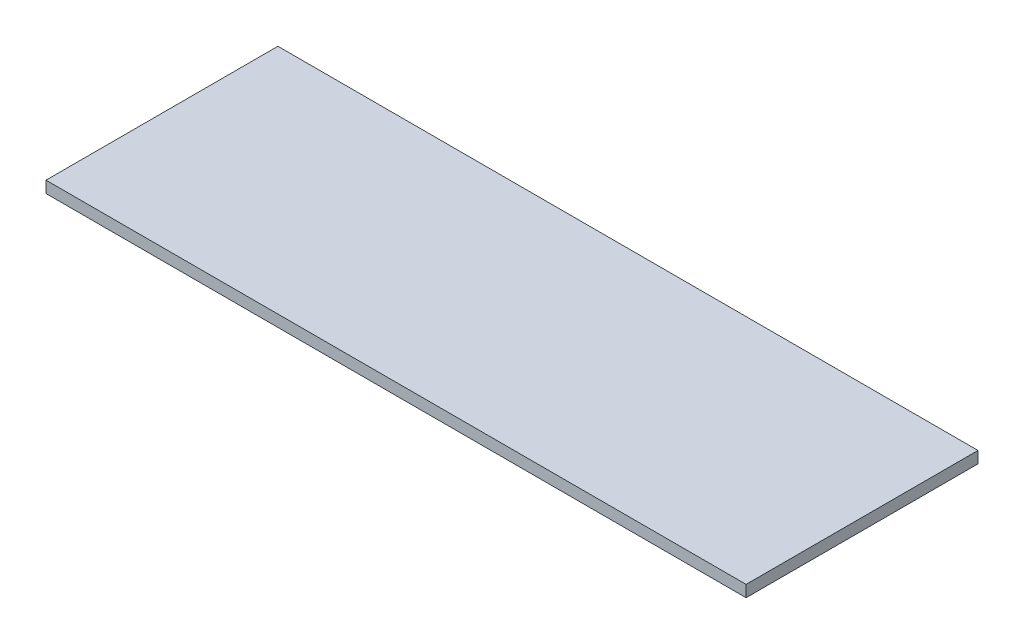
ISO-10303-21;
HEADER;
FILE_DESCRIPTION(('STEP AP214'),'2;1');
FILE_NAME('part.step','',(''),(''),'','','');
FILE_SCHEMA(('AUTOMOTIVE_DESIGN { 1 0 10303 214 1 1 1 1 }'));
ENDSEC;
DATA;
#1=APPLICATION_CONTEXT('core data for automotive mechanical design processes');
#2=APPLICATION_PROTOCOL_DEFINITION('international standard','automotive_design',2000,#1);
#3=PRODUCT_CONTEXT('',#1,'mechanical');
#4=PRODUCT('Part','Part','',(#3));
#5=PRODUCT_RELATED_PRODUCT_CATEGORY('part','',(#4));
#6=PRODUCT_DEFINITION_FORMATION('','',#4);
#7=PRODUCT_DEFINITION_CONTEXT('part definition',#1,'design');
#8=PRODUCT_DEFINITION('design','',#6,#7);
#9=PRODUCT_DEFINITION_SHAPE('','',#8);
#10=(LENGTH_UNIT() NAMED_UNIT(*) SI_UNIT(.MILLI.,.METRE.));
#11=(NAMED_UNIT(*) PLANE_ANGLE_UNIT() SI_UNIT($,.RADIAN.));
#12=(NAMED_UNIT(*) SI_UNIT($,.STERADIAN.) SOLID_ANGLE_UNIT());
#13=UNCERTAINTY_MEASURE_WITH_UNIT(LENGTH_MEASURE(1.E-05),#10,'distance_accuracy_value','');
#14=(GEOMETRIC_REPRESENTATION_CONTEXT(3) GLOBAL_UNCERTAINTY_ASSIGNED_CONTEXT((#13)) GLOBAL_UNIT_ASSIGNED_CONTEXT((#10,
#11,#12)) REPRESENTATION_CONTEXT('',''));
#15=CARTESIAN_POINT('',(0.,0.,0.));
#16=DIRECTION('',(0.,0.,1.));
#17=DIRECTION('',(1.,0.,0.));
#18=AXIS2_PLACEMENT_3D('',#15,#16,#17);
#19=CARTESIAN_POINT('',(0.,19.05,0.));
#20=DIRECTION('',(1.,0.,0.));
#21=DIRECTION('',(0.,0.,-1.));
#22=AXIS2_PLACEMENT_3D('',#19,#20,#21);
#23=PLANE('',#22);
#24=DIRECTION('',(0.,0.,1.));
#25=VECTOR('',#24,1.);
#26=CARTESIAN_POINT('',(0.,0.,0.));
#27=LINE('',#26,#25);
#28=CARTESIAN_POINT('',(0.,0.,0.));
#29=VERTEX_POINT('',#28);
#30=CARTESIAN_POINT('',(0.,0.,380.95));
#31=VERTEX_POINT('',#30);
#32=EDGE_CURVE('E102',#29,#31,#27,.T.);
#33=ORIENTED_EDGE('',*,*,#32,.T.);
#34=DIRECTION('',(0.,-1.,0.));
#35=VECTOR('',#34,1.);
#36=CARTESIAN_POINT('',(0.,19.05,380.95));
#37=LINE('',#36,#35);
#38=CARTESIAN_POINT('',(0.,19.05,380.95));
#39=VERTEX_POINT('',#38);
#40=EDGE_CURVE('E11',#39,#31,#37,.T.);
#41=ORIENTED_EDGE('',*,*,#40,.F.);
#42=DIRECTION('',(0.,0.,1.));
#43=VECTOR('',#42,1.);
#44=CARTESIAN_POINT('',(0.,19.05,0.));
#45=LINE('',#44,#43);
#46=CARTESIAN_POINT('',(0.,19.05,0.));
#47=VERTEX_POINT('',#46);
#48=EDGE_CURVE('E90',#47,#39,#45,.T.);
#49=ORIENTED_EDGE('',*,*,#48,.F.);
#50=DIRECTION('',(0.,-1.,0.));
#51=VECTOR('',#50,1.);
#52=CARTESIAN_POINT('',(0.,19.05,0.));
#53=LINE('',#52,#51);
#54=EDGE_CURVE('E98',#47,#29,#53,.T.);
#55=ORIENTED_EDGE('',*,*,#54,.T.);
#56=EDGE_LOOP('',(#33,#41,#49,#55));
#57=FACE_BOUND('',#56,.T.);
#58=ADVANCED_FACE('F39',(#57),#23,.F.);
#59=CARTESIAN_POINT('',(0.,19.05,380.95));
#60=DIRECTION('',(0.,0.,-1.));
#61=DIRECTION('',(-1.,0.,0.));
#62=AXIS2_PLACEMENT_3D('',#59,#60,#61);
#63=PLANE('',#62);
#64=DIRECTION('',(1.,0.,0.));
#65=VECTOR('',#64,1.);
#66=CARTESIAN_POINT('',(0.,0.,380.95));
#67=LINE('',#66,#65);
#68=CARTESIAN_POINT('',(1150.,0.,380.95));
#69=VERTEX_POINT('',#68);
#70=EDGE_CURVE('E94',#31,#69,#67,.T.);
#71=ORIENTED_EDGE('',*,*,#70,.T.);
#72=DIRECTION('',(0.,-1.,0.));
#73=VECTOR('',#72,1.);
#74=CARTESIAN_POINT('',(1150.,19.05,380.95));
#75=LINE('',#74,#73);
#76=CARTESIAN_POINT('',(1150.,19.05,380.95));
#77=VERTEX_POINT('',#76);
#78=EDGE_CURVE('E47',#77,#69,#75,.T.);
#79=ORIENTED_EDGE('',*,*,#78,.F.);
#80=DIRECTION('',(1.,0.,0.));
#81=VECTOR('',#80,1.);
#82=CARTESIAN_POINT('',(0.,19.05,380.95));
#83=LINE('',#82,#81);
#84=EDGE_CURVE('E85',#39,#77,#83,.T.);
#85=ORIENTED_EDGE('',*,*,#84,.F.);
#86=ORIENTED_EDGE('',*,*,#40,.T.);
#87=EDGE_LOOP('',(#71,#79,#85,#86));
#88=FACE_BOUND('',#87,.T.);
#89=ADVANCED_FACE('F93',(#88),#63,.F.);
#90=CARTESIAN_POINT('',(1150.,19.05,0.));
#91=DIRECTION('',(-1.,0.,0.));
#92=DIRECTION('',(0.,0.,1.));
#93=AXIS2_PLACEMENT_3D('',#90,#91,#92);
#94=PLANE('',#93);
#95=DIRECTION('',(0.,0.,-1.));
#96=VECTOR('',#95,1.);
#97=CARTESIAN_POINT('',(1150.,0.,0.));
#98=LINE('',#97,#96);
#99=CARTESIAN_POINT('',(1150.,0.,0.));
#100=VERTEX_POINT('',#99);
#101=EDGE_CURVE('E72',#69,#100,#98,.T.);
#102=ORIENTED_EDGE('',*,*,#101,.T.);
#103=DIRECTION('',(0.,-1.,0.));
#104=VECTOR('',#103,1.);
#105=CARTESIAN_POINT('',(1150.,19.05,0.));
#106=LINE('',#105,#104);
#107=CARTESIAN_POINT('',(1150.,19.05,0.));
#108=VERTEX_POINT('',#107);
#109=EDGE_CURVE('E95',#108,#100,#106,.T.);
#110=ORIENTED_EDGE('',*,*,#109,.F.);
#111=DIRECTION('',(0.,0.,-1.));
#112=VECTOR('',#111,1.);
#113=CARTESIAN_POINT('',(1150.,19.05,0.));
#114=LINE('',#113,#112);
#115=EDGE_CURVE('E88',#77,#108,#114,.T.);
#116=ORIENTED_EDGE('',*,*,#115,.F.);
#117=ORIENTED_EDGE('',*,*,#78,.T.);
#118=EDGE_LOOP('',(#102,#110,#116,#117));
#119=FACE_BOUND('',#118,.T.);
#120=ADVANCED_FACE('F96',(#119),#94,.F.);
#121=CARTESIAN_POINT('',(0.,19.05,0.));
#122=DIRECTION('',(0.,0.,1.));
#123=DIRECTION('',(1.,0.,0.));
#124=AXIS2_PLACEMENT_3D('',#121,#122,#123);
#125=PLANE('',#124);
#126=DIRECTION('',(-1.,0.,0.));
#127=VECTOR('',#126,1.);
#128=CARTESIAN_POINT('',(0.,0.,0.));
#129=LINE('',#128,#127);
#130=EDGE_CURVE('E78',#100,#29,#129,.T.);
#131=ORIENTED_EDGE('',*,*,#130,.T.);
#132=ORIENTED_EDGE('',*,*,#54,.F.);
#133=DIRECTION('',(-1.,0.,0.));
#134=VECTOR('',#133,1.);
#135=CARTESIAN_POINT('',(0.,19.05,0.));
#136=LINE('',#135,#134);
#137=EDGE_CURVE('E55',#108,#47,#136,.T.);
#138=ORIENTED_EDGE('',*,*,#137,.F.);
#139=ORIENTED_EDGE('',*,*,#109,.T.);
#140=EDGE_LOOP('',(#131,#132,#138,#139));
#141=FACE_BOUND('',#140,.T.);
#142=ADVANCED_FACE('F109',(#141),#125,.F.);
#143=CARTESIAN_POINT('',(0.,19.05,0.));
#144=DIRECTION('',(0.,1.,0.));
#145=DIRECTION('',(0.,0.,1.));
#146=AXIS2_PLACEMENT_3D('',#143,#144,#145);
#147=PLANE('',#146);
#148=ORIENTED_EDGE('',*,*,#48,.T.);
#149=ORIENTED_EDGE('',*,*,#84,.T.);
#150=ORIENTED_EDGE('',*,*,#115,.T.);
#151=ORIENTED_EDGE('',*,*,#137,.T.);
#152=EDGE_LOOP('',(#148,#149,#150,#151));
#153=FACE_BOUND('',#152,.T.);
#154=ADVANCED_FACE('F86',(#153),#147,.T.);
#155=CARTESIAN_POINT('',(0.,0.,0.));
#156=DIRECTION('',(0.,1.,0.));
#157=DIRECTION('',(0.,0.,1.));
#158=AXIS2_PLACEMENT_3D('',#155,#156,#157);
#159=PLANE('',#158);
#160=ORIENTED_EDGE('',*,*,#32,.F.);
#161=ORIENTED_EDGE('',*,*,#130,.F.);
#162=ORIENTED_EDGE('',*,*,#101,.F.);
#163=ORIENTED_EDGE('',*,*,#70,.F.);
#164=EDGE_LOOP('',(#160,#161,#162,#163));
#165=FACE_BOUND('',#164,.T.);
#166=ADVANCED_FACE('F112',(#165),#159,.F.);
#167=CLOSED_SHELL('',(#58,#89,#120,#142,#154,#166));
#168=MANIFOLD_SOLID_BREP('B2',#167);
#169=ADVANCED_BREP_SHAPE_REPRESENTATION('',(#18,#168),#14);
#170=SHAPE_DEFINITION_REPRESENTATION(#9,#169);
ENDSEC;
END-ISO-10303-21;
